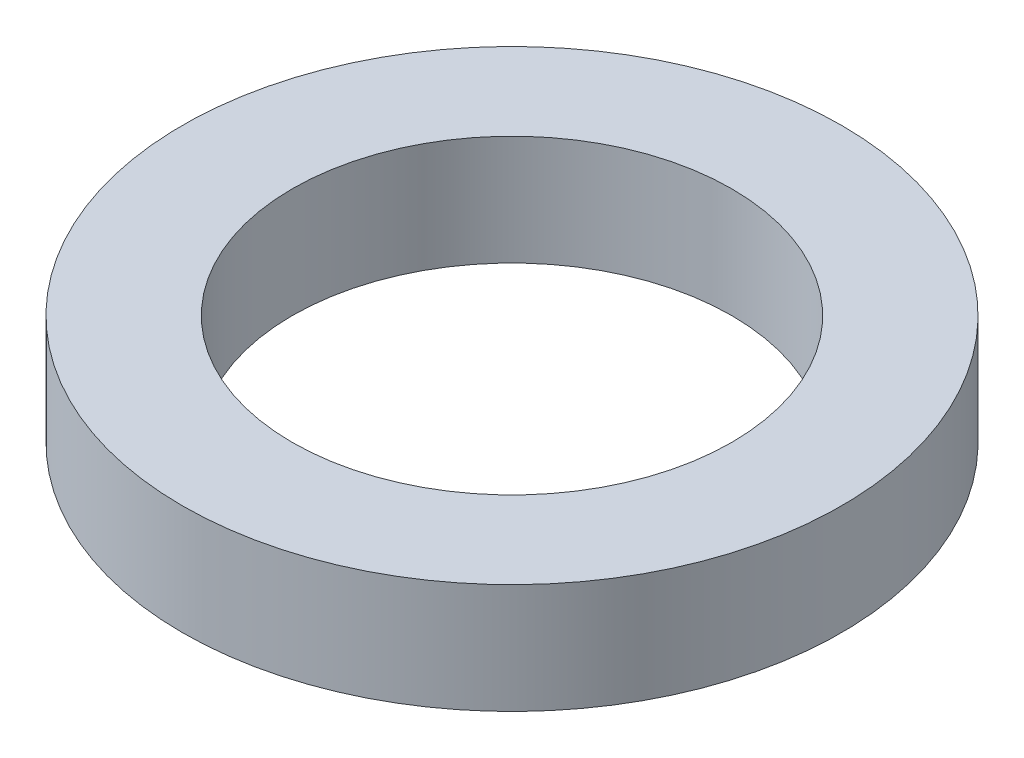
ISO-10303-21;
HEADER;
FILE_DESCRIPTION(('STEP AP214'),'2;1');
FILE_NAME('part.step','',(''),(''),'','','');
FILE_SCHEMA(('AUTOMOTIVE_DESIGN { 1 0 10303 214 1 1 1 1 }'));
ENDSEC;
DATA;
#1=APPLICATION_CONTEXT('core data for automotive mechanical design processes');
#2=APPLICATION_PROTOCOL_DEFINITION('international standard','automotive_design',2000,#1);
#3=PRODUCT_CONTEXT('',#1,'mechanical');
#4=PRODUCT('Part','Part','',(#3));
#5=PRODUCT_RELATED_PRODUCT_CATEGORY('part','',(#4));
#6=PRODUCT_DEFINITION_FORMATION('','',#4);
#7=PRODUCT_DEFINITION_CONTEXT('part definition',#1,'design');
#8=PRODUCT_DEFINITION('design','',#6,#7);
#9=PRODUCT_DEFINITION_SHAPE('','',#8);
#10=(LENGTH_UNIT() NAMED_UNIT(*) SI_UNIT(.MILLI.,.METRE.));
#11=(NAMED_UNIT(*) PLANE_ANGLE_UNIT() SI_UNIT($,.RADIAN.));
#12=(NAMED_UNIT(*) SI_UNIT($,.STERADIAN.) SOLID_ANGLE_UNIT());
#13=UNCERTAINTY_MEASURE_WITH_UNIT(LENGTH_MEASURE(1.E-05),#10,'distance_accuracy_value','');
#14=(GEOMETRIC_REPRESENTATION_CONTEXT(3) GLOBAL_UNCERTAINTY_ASSIGNED_CONTEXT((#13)) GLOBAL_UNIT_ASSIGNED_CONTEXT((#10,
#11,#12)) REPRESENTATION_CONTEXT('',''));
#15=CARTESIAN_POINT('',(0.,0.,0.));
#16=DIRECTION('',(0.,0.,1.));
#17=DIRECTION('',(1.,0.,0.));
#18=AXIS2_PLACEMENT_3D('',#15,#16,#17);
#19=CARTESIAN_POINT('',(0.,0.5,0.));
#20=DIRECTION('',(0.,1.,0.));
#21=DIRECTION('',(0.,0.,1.));
#22=AXIS2_PLACEMENT_3D('',#19,#20,#21);
#23=PLANE('',#22);
#24=CARTESIAN_POINT('',(0.,0.5,0.));
#25=DIRECTION('',(0.,1.,0.));
#26=DIRECTION('',(0.,0.,1.));
#27=AXIS2_PLACEMENT_3D('',#24,#25,#26);
#28=CIRCLE('',#27,1.5);
#29=CARTESIAN_POINT('',(0.,0.5,1.5));
#30=VERTEX_POINT('',#29);
#31=EDGE_CURVE('E10',#30,#30,#28,.T.);
#32=ORIENTED_EDGE('',*,*,#31,.T.);
#33=EDGE_LOOP('',(#32));
#34=FACE_BOUND('',#33,.T.);
#35=CARTESIAN_POINT('',(0.,0.5,0.));
#36=DIRECTION('',(0.,1.,0.));
#37=DIRECTION('',(0.,0.,1.));
#38=AXIS2_PLACEMENT_3D('',#35,#36,#37);
#39=CIRCLE('',#38,1.);
#40=CARTESIAN_POINT('',(0.,0.5,1.));
#41=VERTEX_POINT('',#40);
#42=EDGE_CURVE('E48',#41,#41,#39,.T.);
#43=ORIENTED_EDGE('',*,*,#42,.F.);
#44=EDGE_LOOP('',(#43));
#45=FACE_BOUND('',#44,.T.);
#46=ADVANCED_FACE('F37',(#34,#45),#23,.T.);
#47=CARTESIAN_POINT('',(0.,0.,0.));
#48=DIRECTION('',(0.,1.,0.));
#49=DIRECTION('',(0.,0.,1.));
#50=AXIS2_PLACEMENT_3D('',#47,#48,#49);
#51=PLANE('',#50);
#52=CARTESIAN_POINT('',(0.,0.,0.));
#53=DIRECTION('',(0.,1.,0.));
#54=DIRECTION('',(0.,0.,1.));
#55=AXIS2_PLACEMENT_3D('',#52,#53,#54);
#56=CIRCLE('',#55,1.5);
#57=CARTESIAN_POINT('',(0.,0.,1.5));
#58=VERTEX_POINT('',#57);
#59=EDGE_CURVE('E41',#58,#58,#56,.T.);
#60=ORIENTED_EDGE('',*,*,#59,.F.);
#61=EDGE_LOOP('',(#60));
#62=FACE_BOUND('',#61,.T.);
#63=CARTESIAN_POINT('',(0.,0.,0.));
#64=DIRECTION('',(0.,1.,0.));
#65=DIRECTION('',(0.,0.,1.));
#66=AXIS2_PLACEMENT_3D('',#63,#64,#65);
#67=CIRCLE('',#66,1.);
#68=CARTESIAN_POINT('',(0.,0.,1.));
#69=VERTEX_POINT('',#68);
#70=EDGE_CURVE('E50',#69,#69,#67,.T.);
#71=ORIENTED_EDGE('',*,*,#70,.T.);
#72=EDGE_LOOP('',(#71));
#73=FACE_BOUND('',#72,.T.);
#74=ADVANCED_FACE('F60',(#62,#73),#51,.F.);
#75=CARTESIAN_POINT('',(0.,0.5,0.));
#76=DIRECTION('',(0.,-1.,0.));
#77=DIRECTION('',(0.,0.,-1.));
#78=AXIS2_PLACEMENT_3D('',#75,#76,#77);
#79=CYLINDRICAL_SURFACE('',#78,1.5);
#80=ORIENTED_EDGE('',*,*,#31,.F.);
#81=EDGE_LOOP('',(#80));
#82=FACE_BOUND('',#81,.T.);
#83=ORIENTED_EDGE('',*,*,#59,.T.);
#84=EDGE_LOOP('',(#83));
#85=FACE_BOUND('',#84,.T.);
#86=ADVANCED_FACE('F39',(#82,#85),#79,.T.);
#87=CARTESIAN_POINT('',(0.,0.5,0.));
#88=DIRECTION('',(0.,-1.,0.));
#89=DIRECTION('',(0.,0.,-1.));
#90=AXIS2_PLACEMENT_3D('',#87,#88,#89);
#91=CYLINDRICAL_SURFACE('',#90,1.);
#92=ORIENTED_EDGE('',*,*,#42,.T.);
#93=EDGE_LOOP('',(#92));
#94=FACE_BOUND('',#93,.T.);
#95=ORIENTED_EDGE('',*,*,#70,.F.);
#96=EDGE_LOOP('',(#95));
#97=FACE_BOUND('',#96,.T.);
#98=ADVANCED_FACE('F56',(#94,#97),#91,.F.);
#99=CLOSED_SHELL('',(#46,#74,#86,#98));
#100=MANIFOLD_SOLID_BREP('B2',#99);
#101=ADVANCED_BREP_SHAPE_REPRESENTATION('',(#18,#100),#14);
#102=SHAPE_DEFINITION_REPRESENTATION(#9,#101);
ENDSEC;
END-ISO-10303-21;
